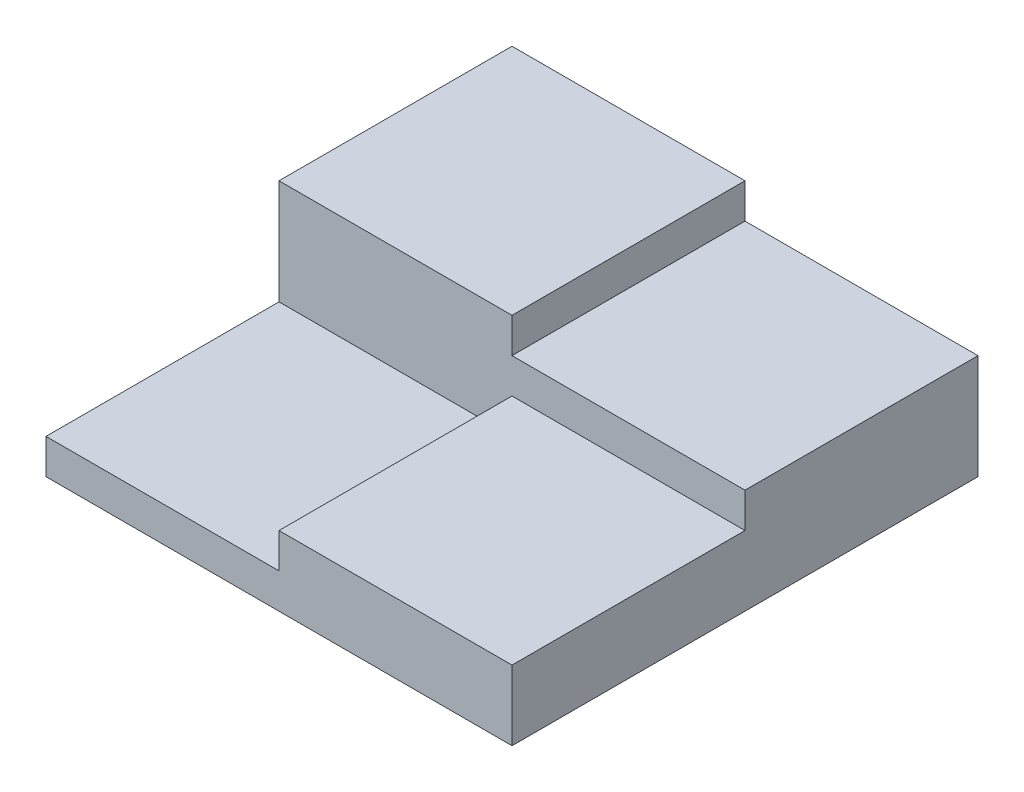
ISO-10303-21;
HEADER;
FILE_DESCRIPTION(('STEP AP214'),'2;1');
FILE_NAME('part.step','',(''),(''),'','','');
FILE_SCHEMA(('AUTOMOTIVE_DESIGN { 1 0 10303 214 1 1 1 1 }'));
ENDSEC;
DATA;
#1=APPLICATION_CONTEXT('core data for automotive mechanical design processes');
#2=APPLICATION_PROTOCOL_DEFINITION('international standard','automotive_design',2000,#1);
#3=PRODUCT_CONTEXT('',#1,'mechanical');
#4=PRODUCT('Part','Part','',(#3));
#5=PRODUCT_RELATED_PRODUCT_CATEGORY('part','',(#4));
#6=PRODUCT_DEFINITION_FORMATION('','',#4);
#7=PRODUCT_DEFINITION_CONTEXT('part definition',#1,'design');
#8=PRODUCT_DEFINITION('design','',#6,#7);
#9=PRODUCT_DEFINITION_SHAPE('','',#8);
#10=(LENGTH_UNIT() NAMED_UNIT(*) SI_UNIT(.MILLI.,.METRE.));
#11=(NAMED_UNIT(*) PLANE_ANGLE_UNIT() SI_UNIT($,.RADIAN.));
#12=(NAMED_UNIT(*) SI_UNIT($,.STERADIAN.) SOLID_ANGLE_UNIT());
#13=UNCERTAINTY_MEASURE_WITH_UNIT(LENGTH_MEASURE(1.E-05),#10,'distance_accuracy_value','');
#14=(GEOMETRIC_REPRESENTATION_CONTEXT(3) GLOBAL_UNCERTAINTY_ASSIGNED_CONTEXT((#13)) GLOBAL_UNIT_ASSIGNED_CONTEXT((#10,
#11,#12)) REPRESENTATION_CONTEXT('',''));
#15=CARTESIAN_POINT('',(0.,0.,0.));
#16=DIRECTION('',(0.,0.,1.));
#17=DIRECTION('',(1.,0.,0.));
#18=AXIS2_PLACEMENT_3D('',#15,#16,#17);
#19=CARTESIAN_POINT('',(-10.,4.5,-10.));
#20=DIRECTION('',(0.,-1.,0.));
#21=DIRECTION('',(0.,0.,-1.));
#22=AXIS2_PLACEMENT_3D('',#19,#20,#21);
#23=PLANE('',#22);
#24=DIRECTION('',(0.,0.,-1.));
#25=VECTOR('',#24,1.);
#26=CARTESIAN_POINT('',(0.,4.5,0.));
#27=LINE('',#26,#25);
#28=CARTESIAN_POINT('',(0.,4.5,0.));
#29=VERTEX_POINT('',#28);
#30=CARTESIAN_POINT('',(0.,4.5,-10.));
#31=VERTEX_POINT('',#30);
#32=EDGE_CURVE('E48',#29,#31,#27,.T.);
#33=ORIENTED_EDGE('',*,*,#32,.F.);
#34=DIRECTION('',(1.,0.,0.));
#35=VECTOR('',#34,1.);
#36=CARTESIAN_POINT('',(-10.,4.5,0.));
#37=LINE('',#36,#35);
#38=CARTESIAN_POINT('',(10.,4.5,0.));
#39=VERTEX_POINT('',#38);
#40=EDGE_CURVE('E166',#29,#39,#37,.T.);
#41=ORIENTED_EDGE('',*,*,#40,.T.);
#42=DIRECTION('',(0.,0.,-1.));
#43=VECTOR('',#42,1.);
#44=CARTESIAN_POINT('',(10.,4.5,0.));
#45=LINE('',#44,#43);
#46=CARTESIAN_POINT('',(10.,4.5,-10.));
#47=VERTEX_POINT('',#46);
#48=EDGE_CURVE('E165',#39,#47,#45,.T.);
#49=ORIENTED_EDGE('',*,*,#48,.T.);
#50=DIRECTION('',(-1.,0.,0.));
#51=VECTOR('',#50,1.);
#52=CARTESIAN_POINT('',(-10.,4.5,-10.));
#53=LINE('',#52,#51);
#54=EDGE_CURVE('E141',#47,#31,#53,.T.);
#55=ORIENTED_EDGE('',*,*,#54,.T.);
#56=EDGE_LOOP('',(#33,#41,#49,#55));
#57=FACE_BOUND('',#56,.T.);
#58=ADVANCED_FACE('F31',(#57),#23,.F.);
#59=CARTESIAN_POINT('',(10.,1.5,-10.));
#60=DIRECTION('',(0.,-1.,0.));
#61=DIRECTION('',(0.,0.,-1.));
#62=AXIS2_PLACEMENT_3D('',#59,#60,#61);
#63=PLANE('',#62);
#64=DIRECTION('',(0.,0.,1.));
#65=VECTOR('',#64,1.);
#66=CARTESIAN_POINT('',(0.,1.5,0.));
#67=LINE('',#66,#65);
#68=CARTESIAN_POINT('',(0.,1.5,0.));
#69=VERTEX_POINT('',#68);
#70=CARTESIAN_POINT('',(0.,1.5,10.));
#71=VERTEX_POINT('',#70);
#72=EDGE_CURVE('E133',#69,#71,#67,.T.);
#73=ORIENTED_EDGE('',*,*,#72,.F.);
#74=DIRECTION('',(1.,0.,0.));
#75=VECTOR('',#74,1.);
#76=CARTESIAN_POINT('',(-10.,1.5,0.));
#77=LINE('',#76,#75);
#78=CARTESIAN_POINT('',(-10.,1.5,0.));
#79=VERTEX_POINT('',#78);
#80=EDGE_CURVE('E162',#79,#69,#77,.T.);
#81=ORIENTED_EDGE('',*,*,#80,.F.);
#82=DIRECTION('',(0.,0.,1.));
#83=VECTOR('',#82,1.);
#84=CARTESIAN_POINT('',(-10.,1.5,10.));
#85=LINE('',#84,#83);
#86=CARTESIAN_POINT('',(-10.,1.5,10.));
#87=VERTEX_POINT('',#86);
#88=EDGE_CURVE('E182',#79,#87,#85,.T.);
#89=ORIENTED_EDGE('',*,*,#88,.T.);
#90=DIRECTION('',(1.,0.,0.));
#91=VECTOR('',#90,1.);
#92=CARTESIAN_POINT('',(-10.,1.5,10.));
#93=LINE('',#92,#91);
#94=EDGE_CURVE('E188',#87,#71,#93,.T.);
#95=ORIENTED_EDGE('',*,*,#94,.T.);
#96=EDGE_LOOP('',(#73,#81,#89,#95));
#97=FACE_BOUND('',#96,.T.);
#98=ADVANCED_FACE('F230',(#97),#63,.F.);
#99=CARTESIAN_POINT('',(-10.,4.5,0.));
#100=DIRECTION('',(0.,0.,-1.));
#101=DIRECTION('',(-1.,0.,0.));
#102=AXIS2_PLACEMENT_3D('',#99,#100,#101);
#103=PLANE('',#102);
#104=DIRECTION('',(0.,-1.,0.));
#105=VECTOR('',#104,1.);
#106=CARTESIAN_POINT('',(0.,3.,0.));
#107=LINE('',#106,#105);
#108=CARTESIAN_POINT('',(0.,3.,0.));
#109=VERTEX_POINT('',#108);
#110=EDGE_CURVE('E157',#109,#69,#107,.T.);
#111=ORIENTED_EDGE('',*,*,#110,.F.);
#112=DIRECTION('',(-1.,0.,0.));
#113=VECTOR('',#112,1.);
#114=CARTESIAN_POINT('',(0.,3.,0.));
#115=LINE('',#114,#113);
#116=CARTESIAN_POINT('',(10.,3.,0.));
#117=VERTEX_POINT('',#116);
#118=EDGE_CURVE('E156',#117,#109,#115,.T.);
#119=ORIENTED_EDGE('',*,*,#118,.F.);
#120=DIRECTION('',(0.,-1.,0.));
#121=VECTOR('',#120,1.);
#122=CARTESIAN_POINT('',(10.,4.5,0.));
#123=LINE('',#122,#121);
#124=EDGE_CURVE('E174',#39,#117,#123,.T.);
#125=ORIENTED_EDGE('',*,*,#124,.F.);
#126=ORIENTED_EDGE('',*,*,#40,.F.);
#127=DIRECTION('',(0.,-1.,0.));
#128=VECTOR('',#127,1.);
#129=CARTESIAN_POINT('',(0.,6.,0.));
#130=LINE('',#129,#128);
#131=CARTESIAN_POINT('',(0.,6.,0.));
#132=VERTEX_POINT('',#131);
#133=EDGE_CURVE('E134',#132,#29,#130,.T.);
#134=ORIENTED_EDGE('',*,*,#133,.F.);
#135=DIRECTION('',(1.,0.,0.));
#136=VECTOR('',#135,1.);
#137=CARTESIAN_POINT('',(0.,6.,0.));
#138=LINE('',#137,#136);
#139=CARTESIAN_POINT('',(-10.,6.,0.));
#140=VERTEX_POINT('',#139);
#141=EDGE_CURVE('E127',#140,#132,#138,.T.);
#142=ORIENTED_EDGE('',*,*,#141,.F.);
#143=DIRECTION('',(0.,-1.,0.));
#144=VECTOR('',#143,1.);
#145=CARTESIAN_POINT('',(-10.,4.5,0.));
#146=LINE('',#145,#144);
#147=EDGE_CURVE('E170',#140,#79,#146,.T.);
#148=ORIENTED_EDGE('',*,*,#147,.T.);
#149=ORIENTED_EDGE('',*,*,#80,.T.);
#150=EDGE_LOOP('',(#111,#119,#125,#126,#134,#142,#148,#149));
#151=FACE_BOUND('',#150,.T.);
#152=ADVANCED_FACE('F222',(#151),#103,.F.);
#153=CARTESIAN_POINT('',(10.,1.5,10.));
#154=DIRECTION('',(-1.,0.,0.));
#155=DIRECTION('',(0.,0.,1.));
#156=AXIS2_PLACEMENT_3D('',#153,#154,#155);
#157=PLANE('',#156);
#158=DIRECTION('',(0.,0.,-1.));
#159=VECTOR('',#158,1.);
#160=CARTESIAN_POINT('',(10.,0.,10.));
#161=LINE('',#160,#159);
#162=CARTESIAN_POINT('',(10.,0.,10.));
#163=VERTEX_POINT('',#162);
#164=CARTESIAN_POINT('',(10.,0.,-10.));
#165=VERTEX_POINT('',#164);
#166=EDGE_CURVE('E173',#163,#165,#161,.T.);
#167=ORIENTED_EDGE('',*,*,#166,.T.);
#168=DIRECTION('',(0.,-1.,0.));
#169=VECTOR('',#168,1.);
#170=CARTESIAN_POINT('',(10.,1.5,-10.));
#171=LINE('',#170,#169);
#172=EDGE_CURVE('E11',#47,#165,#171,.T.);
#173=ORIENTED_EDGE('',*,*,#172,.F.);
#174=ORIENTED_EDGE('',*,*,#48,.F.);
#175=ORIENTED_EDGE('',*,*,#124,.T.);
#176=DIRECTION('',(0.,0.,-1.));
#177=VECTOR('',#176,1.);
#178=CARTESIAN_POINT('',(10.,3.,0.));
#179=LINE('',#178,#177);
#180=CARTESIAN_POINT('',(10.,3.,10.));
#181=VERTEX_POINT('',#180);
#182=EDGE_CURVE('E56',#181,#117,#179,.T.);
#183=ORIENTED_EDGE('',*,*,#182,.F.);
#184=DIRECTION('',(0.,-1.,0.));
#185=VECTOR('',#184,1.);
#186=CARTESIAN_POINT('',(10.,1.5,10.));
#187=LINE('',#186,#185);
#188=EDGE_CURVE('E191',#181,#163,#187,.T.);
#189=ORIENTED_EDGE('',*,*,#188,.T.);
#190=EDGE_LOOP('',(#167,#173,#174,#175,#183,#189));
#191=FACE_BOUND('',#190,.T.);
#192=ADVANCED_FACE('F33',(#191),#157,.F.);
#193=CARTESIAN_POINT('',(-10.,1.5,-10.));
#194=DIRECTION('',(0.,0.,1.));
#195=DIRECTION('',(1.,0.,0.));
#196=AXIS2_PLACEMENT_3D('',#193,#194,#195);
#197=PLANE('',#196);
#198=DIRECTION('',(-1.,0.,0.));
#199=VECTOR('',#198,1.);
#200=CARTESIAN_POINT('',(-10.,0.,-10.));
#201=LINE('',#200,#199);
#202=CARTESIAN_POINT('',(-10.,0.,-10.));
#203=VERTEX_POINT('',#202);
#204=EDGE_CURVE('E194',#165,#203,#201,.T.);
#205=ORIENTED_EDGE('',*,*,#204,.T.);
#206=DIRECTION('',(0.,-1.,0.));
#207=VECTOR('',#206,1.);
#208=CARTESIAN_POINT('',(-10.,1.5,-10.));
#209=LINE('',#208,#207);
#210=CARTESIAN_POINT('',(-10.,6.,-10.));
#211=VERTEX_POINT('',#210);
#212=EDGE_CURVE('E40',#211,#203,#209,.T.);
#213=ORIENTED_EDGE('',*,*,#212,.F.);
#214=DIRECTION('',(-1.,0.,0.));
#215=VECTOR('',#214,1.);
#216=CARTESIAN_POINT('',(0.,6.,-10.));
#217=LINE('',#216,#215);
#218=CARTESIAN_POINT('',(0.,6.,-10.));
#219=VERTEX_POINT('',#218);
#220=EDGE_CURVE('E111',#219,#211,#217,.T.);
#221=ORIENTED_EDGE('',*,*,#220,.F.);
#222=DIRECTION('',(0.,-1.,0.));
#223=VECTOR('',#222,1.);
#224=CARTESIAN_POINT('',(0.,6.,-10.));
#225=LINE('',#224,#223);
#226=EDGE_CURVE('E116',#219,#31,#225,.T.);
#227=ORIENTED_EDGE('',*,*,#226,.T.);
#228=ORIENTED_EDGE('',*,*,#54,.F.);
#229=ORIENTED_EDGE('',*,*,#172,.T.);
#230=EDGE_LOOP('',(#205,#213,#221,#227,#228,#229));
#231=FACE_BOUND('',#230,.T.);
#232=ADVANCED_FACE('F113',(#231),#197,.F.);
#233=CARTESIAN_POINT('',(-10.,1.5,10.));
#234=DIRECTION('',(1.,0.,0.));
#235=DIRECTION('',(0.,0.,-1.));
#236=AXIS2_PLACEMENT_3D('',#233,#234,#235);
#237=PLANE('',#236);
#238=DIRECTION('',(0.,0.,1.));
#239=VECTOR('',#238,1.);
#240=CARTESIAN_POINT('',(-10.,0.,10.));
#241=LINE('',#240,#239);
#242=CARTESIAN_POINT('',(-10.,0.,10.));
#243=VERTEX_POINT('',#242);
#244=EDGE_CURVE('E196',#203,#243,#241,.T.);
#245=ORIENTED_EDGE('',*,*,#244,.T.);
#246=DIRECTION('',(0.,-1.,0.));
#247=VECTOR('',#246,1.);
#248=CARTESIAN_POINT('',(-10.,1.5,10.));
#249=LINE('',#248,#247);
#250=EDGE_CURVE('E202',#87,#243,#249,.T.);
#251=ORIENTED_EDGE('',*,*,#250,.F.);
#252=ORIENTED_EDGE('',*,*,#88,.F.);
#253=ORIENTED_EDGE('',*,*,#147,.F.);
#254=DIRECTION('',(0.,0.,1.));
#255=VECTOR('',#254,1.);
#256=CARTESIAN_POINT('',(-10.,6.,0.));
#257=LINE('',#256,#255);
#258=EDGE_CURVE('E121',#211,#140,#257,.T.);
#259=ORIENTED_EDGE('',*,*,#258,.F.);
#260=ORIENTED_EDGE('',*,*,#212,.T.);
#261=EDGE_LOOP('',(#245,#251,#252,#253,#259,#260));
#262=FACE_BOUND('',#261,.T.);
#263=ADVANCED_FACE('F207',(#262),#237,.F.);
#264=CARTESIAN_POINT('',(-10.,1.5,10.));
#265=DIRECTION('',(0.,0.,-1.));
#266=DIRECTION('',(-1.,0.,0.));
#267=AXIS2_PLACEMENT_3D('',#264,#265,#266);
#268=PLANE('',#267);
#269=DIRECTION('',(1.,0.,0.));
#270=VECTOR('',#269,1.);
#271=CARTESIAN_POINT('',(-10.,0.,10.));
#272=LINE('',#271,#270);
#273=EDGE_CURVE('E198',#243,#163,#272,.T.);
#274=ORIENTED_EDGE('',*,*,#273,.T.);
#275=ORIENTED_EDGE('',*,*,#188,.F.);
#276=DIRECTION('',(1.,0.,0.));
#277=VECTOR('',#276,1.);
#278=CARTESIAN_POINT('',(0.,3.,10.));
#279=LINE('',#278,#277);
#280=CARTESIAN_POINT('',(0.,3.,10.));
#281=VERTEX_POINT('',#280);
#282=EDGE_CURVE('E153',#281,#181,#279,.T.);
#283=ORIENTED_EDGE('',*,*,#282,.F.);
#284=DIRECTION('',(0.,-1.,0.));
#285=VECTOR('',#284,1.);
#286=CARTESIAN_POINT('',(0.,3.,10.));
#287=LINE('',#286,#285);
#288=EDGE_CURVE('E160',#281,#71,#287,.T.);
#289=ORIENTED_EDGE('',*,*,#288,.T.);
#290=ORIENTED_EDGE('',*,*,#94,.F.);
#291=ORIENTED_EDGE('',*,*,#250,.T.);
#292=EDGE_LOOP('',(#274,#275,#283,#289,#290,#291));
#293=FACE_BOUND('',#292,.T.);
#294=ADVANCED_FACE('F214',(#293),#268,.F.);
#295=CARTESIAN_POINT('',(10.,0.,-10.));
#296=DIRECTION('',(0.,-1.,0.));
#297=DIRECTION('',(0.,0.,-1.));
#298=AXIS2_PLACEMENT_3D('',#295,#296,#297);
#299=PLANE('',#298);
#300=ORIENTED_EDGE('',*,*,#166,.F.);
#301=ORIENTED_EDGE('',*,*,#273,.F.);
#302=ORIENTED_EDGE('',*,*,#244,.F.);
#303=ORIENTED_EDGE('',*,*,#204,.F.);
#304=EDGE_LOOP('',(#300,#301,#302,#303));
#305=FACE_BOUND('',#304,.T.);
#306=ADVANCED_FACE('F212',(#305),#299,.T.);
#307=CARTESIAN_POINT('',(0.,3.,0.));
#308=DIRECTION('',(1.,0.,0.));
#309=DIRECTION('',(0.,0.,-1.));
#310=AXIS2_PLACEMENT_3D('',#307,#308,#309);
#311=PLANE('',#310);
#312=ORIENTED_EDGE('',*,*,#72,.T.);
#313=ORIENTED_EDGE('',*,*,#288,.F.);
#314=DIRECTION('',(0.,0.,1.));
#315=VECTOR('',#314,1.);
#316=CARTESIAN_POINT('',(0.,3.,0.));
#317=LINE('',#316,#315);
#318=EDGE_CURVE('E137',#109,#281,#317,.T.);
#319=ORIENTED_EDGE('',*,*,#318,.F.);
#320=ORIENTED_EDGE('',*,*,#110,.T.);
#321=EDGE_LOOP('',(#312,#313,#319,#320));
#322=FACE_BOUND('',#321,.T.);
#323=ADVANCED_FACE('F227',(#322),#311,.F.);
#324=CARTESIAN_POINT('',(0.,3.,10.));
#325=DIRECTION('',(0.,1.,0.));
#326=DIRECTION('',(0.,0.,1.));
#327=AXIS2_PLACEMENT_3D('',#324,#325,#326);
#328=PLANE('',#327);
#329=ORIENTED_EDGE('',*,*,#318,.T.);
#330=ORIENTED_EDGE('',*,*,#282,.T.);
#331=ORIENTED_EDGE('',*,*,#182,.T.);
#332=ORIENTED_EDGE('',*,*,#118,.T.);
#333=EDGE_LOOP('',(#329,#330,#331,#332));
#334=FACE_BOUND('',#333,.T.);
#335=ADVANCED_FACE('F224',(#334),#328,.T.);
#336=CARTESIAN_POINT('',(0.,6.,0.));
#337=DIRECTION('',(-1.,0.,0.));
#338=DIRECTION('',(0.,0.,1.));
#339=AXIS2_PLACEMENT_3D('',#336,#337,#338);
#340=PLANE('',#339);
#341=ORIENTED_EDGE('',*,*,#32,.T.);
#342=ORIENTED_EDGE('',*,*,#226,.F.);
#343=DIRECTION('',(0.,0.,-1.));
#344=VECTOR('',#343,1.);
#345=CARTESIAN_POINT('',(0.,6.,0.));
#346=LINE('',#345,#344);
#347=EDGE_CURVE('E122',#132,#219,#346,.T.);
#348=ORIENTED_EDGE('',*,*,#347,.F.);
#349=ORIENTED_EDGE('',*,*,#133,.T.);
#350=EDGE_LOOP('',(#341,#342,#348,#349));
#351=FACE_BOUND('',#350,.T.);
#352=ADVANCED_FACE('F132',(#351),#340,.F.);
#353=CARTESIAN_POINT('',(0.,6.,-10.));
#354=DIRECTION('',(0.,1.,0.));
#355=DIRECTION('',(0.,0.,1.));
#356=AXIS2_PLACEMENT_3D('',#353,#354,#355);
#357=PLANE('',#356);
#358=ORIENTED_EDGE('',*,*,#347,.T.);
#359=ORIENTED_EDGE('',*,*,#220,.T.);
#360=ORIENTED_EDGE('',*,*,#258,.T.);
#361=ORIENTED_EDGE('',*,*,#141,.T.);
#362=EDGE_LOOP('',(#358,#359,#360,#361));
#363=FACE_BOUND('',#362,.T.);
#364=ADVANCED_FACE('F125',(#363),#357,.T.);
#365=CLOSED_SHELL('',(#58,#98,#152,#192,#232,#263,#294,#306,#323,#335,#352,#364));
#366=MANIFOLD_SOLID_BREP('B2',#365);
#367=ADVANCED_BREP_SHAPE_REPRESENTATION('',(#18,#366),#14);
#368=SHAPE_DEFINITION_REPRESENTATION(#9,#367);
ENDSEC;
END-ISO-10303-21;
